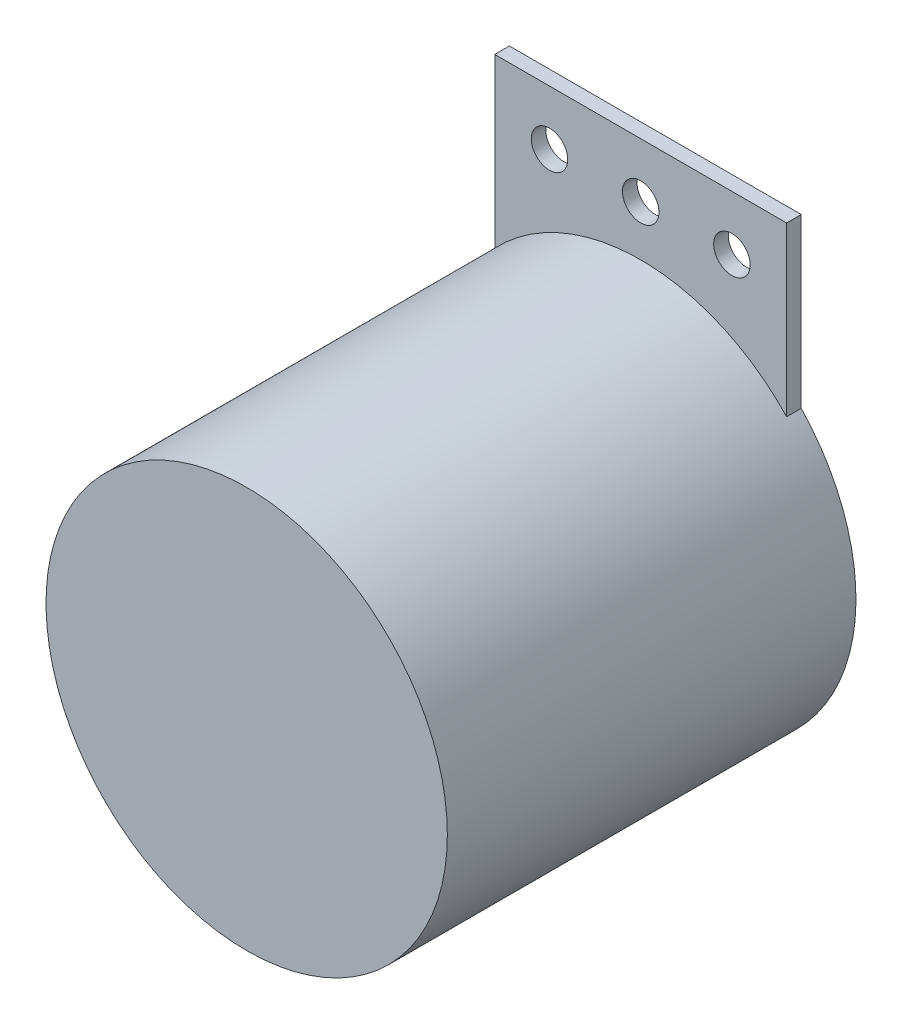
ISO-10303-21;
HEADER;
FILE_DESCRIPTION(('STEP AP214'),'2;1');
FILE_NAME('part.step','',(''),(''),'','','');
FILE_SCHEMA(('AUTOMOTIVE_DESIGN { 1 0 10303 214 1 1 1 1 }'));
ENDSEC;
DATA;
#1=APPLICATION_CONTEXT('core data for automotive mechanical design processes');
#2=APPLICATION_PROTOCOL_DEFINITION('international standard','automotive_design',2000,#1);
#3=PRODUCT_CONTEXT('',#1,'mechanical');
#4=PRODUCT('Part','Part','',(#3));
#5=PRODUCT_RELATED_PRODUCT_CATEGORY('part','',(#4));
#6=PRODUCT_DEFINITION_FORMATION('','',#4);
#7=PRODUCT_DEFINITION_CONTEXT('part definition',#1,'design');
#8=PRODUCT_DEFINITION('design','',#6,#7);
#9=PRODUCT_DEFINITION_SHAPE('','',#8);
#10=(LENGTH_UNIT() NAMED_UNIT(*) SI_UNIT(.MILLI.,.METRE.));
#11=(NAMED_UNIT(*) PLANE_ANGLE_UNIT() SI_UNIT($,.RADIAN.));
#12=(NAMED_UNIT(*) SI_UNIT($,.STERADIAN.) SOLID_ANGLE_UNIT());
#13=UNCERTAINTY_MEASURE_WITH_UNIT(LENGTH_MEASURE(1.E-05),#10,'distance_accuracy_value','');
#14=(GEOMETRIC_REPRESENTATION_CONTEXT(3) GLOBAL_UNCERTAINTY_ASSIGNED_CONTEXT((#13)) GLOBAL_UNIT_ASSIGNED_CONTEXT((#10,
#11,#12)) REPRESENTATION_CONTEXT('',''));
#15=CARTESIAN_POINT('',(0.,0.,0.));
#16=DIRECTION('',(0.,0.,1.));
#17=DIRECTION('',(1.,0.,0.));
#18=AXIS2_PLACEMENT_3D('',#15,#16,#17);
#19=CARTESIAN_POINT('',(0.,0.,56.));
#20=DIRECTION('',(0.,0.,-1.));
#21=DIRECTION('',(-1.,0.,0.));
#22=AXIS2_PLACEMENT_3D('',#19,#20,#21);
#23=CYLINDRICAL_SURFACE('',#22,27.5);
#24=CARTESIAN_POINT('',(0.,0.,0.));
#25=DIRECTION('',(0.,0.,1.));
#26=DIRECTION('',(1.,0.,0.));
#27=AXIS2_PLACEMENT_3D('',#24,#25,#26);
#28=CIRCLE('',#27,27.5);
#29=CARTESIAN_POINT('',(-20.,18.8745860881769,0.));
#30=VERTEX_POINT('',#29);
#31=CARTESIAN_POINT('',(20.,18.8745860881769,0.));
#32=VERTEX_POINT('',#31);
#33=EDGE_CURVE('E108',#30,#32,#28,.T.);
#34=ORIENTED_EDGE('',*,*,#33,.T.);
#35=DIRECTION('',(0.,0.,-1.));
#36=VECTOR('',#35,1.);
#37=CARTESIAN_POINT('',(20.,18.8745860881769,2.));
#38=LINE('',#37,#36);
#39=CARTESIAN_POINT('',(20.,18.8745860881769,2.));
#40=VERTEX_POINT('',#39);
#41=EDGE_CURVE('E49',#40,#32,#38,.T.);
#42=ORIENTED_EDGE('',*,*,#41,.F.);
#43=CARTESIAN_POINT('',(0.,0.,2.));
#44=DIRECTION('',(0.,0.,-1.));
#45=DIRECTION('',(-1.,0.,0.));
#46=AXIS2_PLACEMENT_3D('',#43,#44,#45);
#47=CIRCLE('',#46,27.5);
#48=CARTESIAN_POINT('',(-20.,18.8745860881769,2.));
#49=VERTEX_POINT('',#48);
#50=EDGE_CURVE('E11',#49,#40,#47,.T.);
#51=ORIENTED_EDGE('',*,*,#50,.F.);
#52=DIRECTION('',(0.,0.,-1.));
#53=VECTOR('',#52,1.);
#54=CARTESIAN_POINT('',(-20.,18.8745860881769,2.));
#55=LINE('',#54,#53);
#56=EDGE_CURVE('E84',#49,#30,#55,.T.);
#57=ORIENTED_EDGE('',*,*,#56,.T.);
#58=EDGE_LOOP('',(#34,#42,#51,#57));
#59=FACE_BOUND('',#58,.T.);
#60=CARTESIAN_POINT('',(0.,0.,56.));
#61=DIRECTION('',(0.,0.,1.));
#62=DIRECTION('',(1.,0.,0.));
#63=AXIS2_PLACEMENT_3D('',#60,#61,#62);
#64=CIRCLE('',#63,27.5);
#65=CARTESIAN_POINT('',(27.5,0.,56.));
#66=VERTEX_POINT('',#65);
#67=EDGE_CURVE('E42',#66,#66,#64,.T.);
#68=ORIENTED_EDGE('',*,*,#67,.F.);
#69=EDGE_LOOP('',(#68));
#70=FACE_BOUND('',#69,.T.);
#71=ADVANCED_FACE('F35',(#59,#70),#23,.T.);
#72=CARTESIAN_POINT('',(0.,0.,56.));
#73=DIRECTION('',(0.,0.,1.));
#74=DIRECTION('',(1.,0.,0.));
#75=AXIS2_PLACEMENT_3D('',#72,#73,#74);
#76=PLANE('',#75);
#77=ORIENTED_EDGE('',*,*,#67,.T.);
#78=EDGE_LOOP('',(#77));
#79=FACE_BOUND('',#78,.T.);
#80=ADVANCED_FACE('F119',(#79),#76,.T.);
#81=CARTESIAN_POINT('',(0.,0.,0.));
#82=DIRECTION('',(0.,0.,1.));
#83=DIRECTION('',(1.,0.,0.));
#84=AXIS2_PLACEMENT_3D('',#81,#82,#83);
#85=PLANE('',#84);
#86=CARTESIAN_POINT('',(12.5,34.3745860881769,0.));
#87=DIRECTION('',(0.,0.,1.));
#88=DIRECTION('',(1.,0.,0.));
#89=AXIS2_PLACEMENT_3D('',#86,#87,#88);
#90=CIRCLE('',#89,2.5);
#91=CARTESIAN_POINT('',(15.,34.3745860881769,0.));
#92=VERTEX_POINT('',#91);
#93=EDGE_CURVE('E213',#92,#92,#90,.T.);
#94=ORIENTED_EDGE('',*,*,#93,.T.);
#95=EDGE_LOOP('',(#94));
#96=FACE_BOUND('',#95,.T.);
#97=CARTESIAN_POINT('',(-12.5,34.3745860881769,0.));
#98=DIRECTION('',(0.,0.,1.));
#99=DIRECTION('',(1.,0.,0.));
#100=AXIS2_PLACEMENT_3D('',#97,#98,#99);
#101=CIRCLE('',#100,2.5);
#102=CARTESIAN_POINT('',(-10.,34.3745860881769,0.));
#103=VERTEX_POINT('',#102);
#104=EDGE_CURVE('E221',#103,#103,#101,.T.);
#105=ORIENTED_EDGE('',*,*,#104,.T.);
#106=EDGE_LOOP('',(#105));
#107=FACE_BOUND('',#106,.T.);
#108=CARTESIAN_POINT('',(0.,34.3745860881769,0.));
#109=DIRECTION('',(0.,0.,1.));
#110=DIRECTION('',(1.,0.,0.));
#111=AXIS2_PLACEMENT_3D('',#108,#109,#110);
#112=CIRCLE('',#111,2.5);
#113=CARTESIAN_POINT('',(2.5,34.3745860881769,0.));
#114=VERTEX_POINT('',#113);
#115=EDGE_CURVE('E105',#114,#114,#112,.T.);
#116=ORIENTED_EDGE('',*,*,#115,.T.);
#117=EDGE_LOOP('',(#116));
#118=FACE_BOUND('',#117,.T.);
#119=ORIENTED_EDGE('',*,*,#33,.F.);
#120=DIRECTION('',(0.,1.,0.));
#121=VECTOR('',#120,1.);
#122=CARTESIAN_POINT('',(-20.,18.8745860881769,0.));
#123=LINE('',#122,#121);
#124=CARTESIAN_POINT('',(-20.,41.8745860881769,0.));
#125=VERTEX_POINT('',#124);
#126=EDGE_CURVE('E103',#30,#125,#123,.T.);
#127=ORIENTED_EDGE('',*,*,#126,.T.);
#128=DIRECTION('',(1.,0.,0.));
#129=VECTOR('',#128,1.);
#130=CARTESIAN_POINT('',(-20.,41.8745860881769,0.));
#131=LINE('',#130,#129);
#132=CARTESIAN_POINT('',(20.,41.8745860881769,0.));
#133=VERTEX_POINT('',#132);
#134=EDGE_CURVE('E78',#125,#133,#131,.T.);
#135=ORIENTED_EDGE('',*,*,#134,.T.);
#136=DIRECTION('',(0.,-1.,0.));
#137=VECTOR('',#136,1.);
#138=CARTESIAN_POINT('',(20.,41.8745860881769,0.));
#139=LINE('',#138,#137);
#140=EDGE_CURVE('E94',#133,#32,#139,.T.);
#141=ORIENTED_EDGE('',*,*,#140,.T.);
#142=EDGE_LOOP('',(#119,#127,#135,#141));
#143=FACE_BOUND('',#142,.T.);
#144=ADVANCED_FACE('F117',(#96,#107,#118,#143),#85,.F.);
#145=CARTESIAN_POINT('',(20.,41.8745860881769,2.));
#146=DIRECTION('',(1.,0.,0.));
#147=DIRECTION('',(0.,0.,-1.));
#148=AXIS2_PLACEMENT_3D('',#145,#146,#147);
#149=PLANE('',#148);
#150=ORIENTED_EDGE('',*,*,#140,.F.);
#151=DIRECTION('',(0.,0.,-1.));
#152=VECTOR('',#151,1.);
#153=CARTESIAN_POINT('',(20.,41.8745860881769,2.));
#154=LINE('',#153,#152);
#155=CARTESIAN_POINT('',(20.,41.8745860881769,2.));
#156=VERTEX_POINT('',#155);
#157=EDGE_CURVE('E83',#156,#133,#154,.T.);
#158=ORIENTED_EDGE('',*,*,#157,.F.);
#159=DIRECTION('',(0.,-1.,0.));
#160=VECTOR('',#159,1.);
#161=CARTESIAN_POINT('',(20.,41.8745860881769,2.));
#162=LINE('',#161,#160);
#163=EDGE_CURVE('E91',#156,#40,#162,.T.);
#164=ORIENTED_EDGE('',*,*,#163,.T.);
#165=ORIENTED_EDGE('',*,*,#41,.T.);
#166=EDGE_LOOP('',(#150,#158,#164,#165));
#167=FACE_BOUND('',#166,.T.);
#168=ADVANCED_FACE('F116',(#167),#149,.T.);
#169=CARTESIAN_POINT('',(-20.,41.8745860881769,2.));
#170=DIRECTION('',(0.,1.,0.));
#171=DIRECTION('',(0.,0.,1.));
#172=AXIS2_PLACEMENT_3D('',#169,#170,#171);
#173=PLANE('',#172);
#174=ORIENTED_EDGE('',*,*,#134,.F.);
#175=DIRECTION('',(0.,0.,-1.));
#176=VECTOR('',#175,1.);
#177=CARTESIAN_POINT('',(-20.,41.8745860881769,2.));
#178=LINE('',#177,#176);
#179=CARTESIAN_POINT('',(-20.,41.8745860881769,2.));
#180=VERTEX_POINT('',#179);
#181=EDGE_CURVE('E72',#180,#125,#178,.T.);
#182=ORIENTED_EDGE('',*,*,#181,.F.);
#183=DIRECTION('',(1.,0.,0.));
#184=VECTOR('',#183,1.);
#185=CARTESIAN_POINT('',(-20.,41.8745860881769,2.));
#186=LINE('',#185,#184);
#187=EDGE_CURVE('E75',#180,#156,#186,.T.);
#188=ORIENTED_EDGE('',*,*,#187,.T.);
#189=ORIENTED_EDGE('',*,*,#157,.T.);
#190=EDGE_LOOP('',(#174,#182,#188,#189));
#191=FACE_BOUND('',#190,.T.);
#192=ADVANCED_FACE('F74',(#191),#173,.T.);
#193=CARTESIAN_POINT('',(-20.,18.8745860881769,2.));
#194=DIRECTION('',(-1.,0.,0.));
#195=DIRECTION('',(0.,0.,1.));
#196=AXIS2_PLACEMENT_3D('',#193,#194,#195);
#197=PLANE('',#196);
#198=ORIENTED_EDGE('',*,*,#126,.F.);
#199=ORIENTED_EDGE('',*,*,#56,.F.);
#200=DIRECTION('',(0.,1.,0.));
#201=VECTOR('',#200,1.);
#202=CARTESIAN_POINT('',(-20.,18.8745860881769,2.));
#203=LINE('',#202,#201);
#204=EDGE_CURVE('E89',#49,#180,#203,.T.);
#205=ORIENTED_EDGE('',*,*,#204,.T.);
#206=ORIENTED_EDGE('',*,*,#181,.T.);
#207=EDGE_LOOP('',(#198,#199,#205,#206));
#208=FACE_BOUND('',#207,.T.);
#209=ADVANCED_FACE('F93',(#208),#197,.T.);
#210=CARTESIAN_POINT('',(0.,0.,2.));
#211=DIRECTION('',(0.,0.,-1.));
#212=DIRECTION('',(-1.,0.,0.));
#213=AXIS2_PLACEMENT_3D('',#210,#211,#212);
#214=PLANE('',#213);
#215=CARTESIAN_POINT('',(12.5,34.3745860881769,2.));
#216=DIRECTION('',(0.,0.,1.));
#217=DIRECTION('',(1.,0.,0.));
#218=AXIS2_PLACEMENT_3D('',#215,#216,#217);
#219=CIRCLE('',#218,2.5);
#220=CARTESIAN_POINT('',(15.,34.3745860881769,2.));
#221=VERTEX_POINT('',#220);
#222=EDGE_CURVE('E216',#221,#221,#219,.T.);
#223=ORIENTED_EDGE('',*,*,#222,.F.);
#224=EDGE_LOOP('',(#223));
#225=FACE_BOUND('',#224,.T.);
#226=CARTESIAN_POINT('',(-12.5,34.3745860881769,2.));
#227=DIRECTION('',(0.,0.,1.));
#228=DIRECTION('',(1.,0.,0.));
#229=AXIS2_PLACEMENT_3D('',#226,#227,#228);
#230=CIRCLE('',#229,2.5);
#231=CARTESIAN_POINT('',(-10.,34.3745860881769,2.));
#232=VERTEX_POINT('',#231);
#233=EDGE_CURVE('E218',#232,#232,#230,.T.);
#234=ORIENTED_EDGE('',*,*,#233,.F.);
#235=EDGE_LOOP('',(#234));
#236=FACE_BOUND('',#235,.T.);
#237=CARTESIAN_POINT('',(0.,34.3745860881769,2.));
#238=DIRECTION('',(0.,0.,1.));
#239=DIRECTION('',(1.,0.,0.));
#240=AXIS2_PLACEMENT_3D('',#237,#238,#239);
#241=CIRCLE('',#240,2.5);
#242=CARTESIAN_POINT('',(2.5,34.3745860881769,2.));
#243=VERTEX_POINT('',#242);
#244=EDGE_CURVE('E99',#243,#243,#241,.T.);
#245=ORIENTED_EDGE('',*,*,#244,.F.);
#246=EDGE_LOOP('',(#245));
#247=FACE_BOUND('',#246,.T.);
#248=ORIENTED_EDGE('',*,*,#204,.F.);
#249=ORIENTED_EDGE('',*,*,#50,.T.);
#250=ORIENTED_EDGE('',*,*,#163,.F.);
#251=ORIENTED_EDGE('',*,*,#187,.F.);
#252=EDGE_LOOP('',(#248,#249,#250,#251));
#253=FACE_BOUND('',#252,.T.);
#254=ADVANCED_FACE('F88',(#225,#236,#247,#253),#214,.F.);
#255=CARTESIAN_POINT('',(0.,34.3745860881769,0.));
#256=DIRECTION('',(0.,0.,1.));
#257=DIRECTION('',(1.,0.,0.));
#258=AXIS2_PLACEMENT_3D('',#255,#256,#257);
#259=CYLINDRICAL_SURFACE('',#258,2.5);
#260=ORIENTED_EDGE('',*,*,#115,.F.);
#261=EDGE_LOOP('',(#260));
#262=FACE_BOUND('',#261,.T.);
#263=ORIENTED_EDGE('',*,*,#244,.T.);
#264=EDGE_LOOP('',(#263));
#265=FACE_BOUND('',#264,.T.);
#266=ADVANCED_FACE('F175',(#262,#265),#259,.F.);
#267=CARTESIAN_POINT('',(-12.5,34.3745860881769,0.));
#268=DIRECTION('',(0.,0.,1.));
#269=DIRECTION('',(1.,0.,0.));
#270=AXIS2_PLACEMENT_3D('',#267,#268,#269);
#271=CYLINDRICAL_SURFACE('',#270,2.5);
#272=ORIENTED_EDGE('',*,*,#104,.F.);
#273=EDGE_LOOP('',(#272));
#274=FACE_BOUND('',#273,.T.);
#275=ORIENTED_EDGE('',*,*,#233,.T.);
#276=EDGE_LOOP('',(#275));
#277=FACE_BOUND('',#276,.T.);
#278=ADVANCED_FACE('F184',(#274,#277),#271,.F.);
#279=CARTESIAN_POINT('',(12.5,34.3745860881769,0.));
#280=DIRECTION('',(0.,0.,1.));
#281=DIRECTION('',(1.,0.,0.));
#282=AXIS2_PLACEMENT_3D('',#279,#280,#281);
#283=CYLINDRICAL_SURFACE('',#282,2.5);
#284=ORIENTED_EDGE('',*,*,#93,.F.);
#285=EDGE_LOOP('',(#284));
#286=FACE_BOUND('',#285,.T.);
#287=ORIENTED_EDGE('',*,*,#222,.T.);
#288=EDGE_LOOP('',(#287));
#289=FACE_BOUND('',#288,.T.);
#290=ADVANCED_FACE('F193',(#286,#289),#283,.F.);
#291=CLOSED_SHELL('',(#71,#80,#144,#168,#192,#209,#254,#266,#278,#290));
#292=MANIFOLD_SOLID_BREP('B2',#291);
#293=ADVANCED_BREP_SHAPE_REPRESENTATION('',(#18,#292),#14);
#294=SHAPE_DEFINITION_REPRESENTATION(#9,#293);
ENDSEC;
END-ISO-10303-21;
